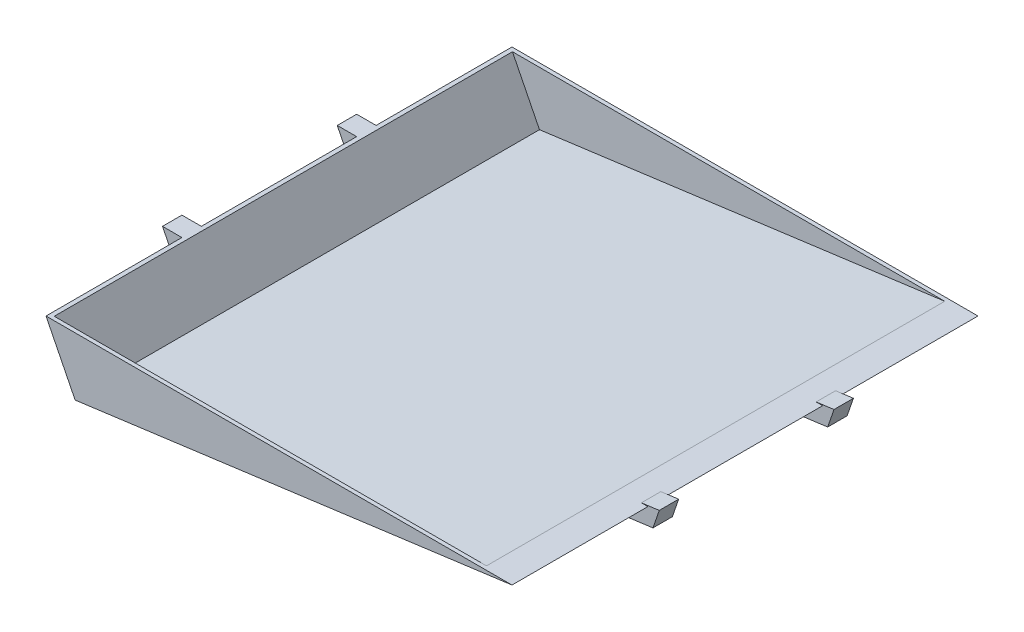
ISO-10303-21;
HEADER;
FILE_DESCRIPTION(('STEP AP214'),'2;1');
FILE_NAME('part.step','',(''),(''),'','','');
FILE_SCHEMA(('AUTOMOTIVE_DESIGN { 1 0 10303 214 1 1 1 1 }'));
ENDSEC;
DATA;
#1=APPLICATION_CONTEXT('core data for automotive mechanical design processes');
#2=APPLICATION_PROTOCOL_DEFINITION('international standard','automotive_design',2000,#1);
#3=PRODUCT_CONTEXT('',#1,'mechanical');
#4=PRODUCT('Part','Part','',(#3));
#5=PRODUCT_RELATED_PRODUCT_CATEGORY('part','',(#4));
#6=PRODUCT_DEFINITION_FORMATION('','',#4);
#7=PRODUCT_DEFINITION_CONTEXT('part definition',#1,'design');
#8=PRODUCT_DEFINITION('design','',#6,#7);
#9=PRODUCT_DEFINITION_SHAPE('','',#8);
#10=(LENGTH_UNIT() NAMED_UNIT(*) SI_UNIT(.MILLI.,.METRE.));
#11=(NAMED_UNIT(*) PLANE_ANGLE_UNIT() SI_UNIT($,.RADIAN.));
#12=(NAMED_UNIT(*) SI_UNIT($,.STERADIAN.) SOLID_ANGLE_UNIT());
#13=UNCERTAINTY_MEASURE_WITH_UNIT(LENGTH_MEASURE(1.E-05),#10,'distance_accuracy_value','');
#14=(GEOMETRIC_REPRESENTATION_CONTEXT(3) GLOBAL_UNCERTAINTY_ASSIGNED_CONTEXT((#13)) GLOBAL_UNIT_ASSIGNED_CONTEXT((#10,
#11,#12)) REPRESENTATION_CONTEXT('',''));
#15=CARTESIAN_POINT('',(0.,0.,0.));
#16=DIRECTION('',(0.,0.,1.));
#17=DIRECTION('',(1.,0.,0.));
#18=AXIS2_PLACEMENT_3D('',#15,#16,#17);
#19=CARTESIAN_POINT('',(599.249327743403,1302.62005408847,1349.8545563695));
#20=DIRECTION('',(0.894427190999916,0.447213595499958,0.));
#21=DIRECTION('',(-0.447213595499958,0.894427190999916,0.));
#22=AXIS2_PLACEMENT_3D('',#19,#20,#21);
#23=PLANE('',#22);
#24=DIRECTION('',(-0.447213595499958,0.894427190999916,0.));
#25=VECTOR('',#24,1.);
#26=CARTESIAN_POINT('',(599.249327743403,1302.62005408847,1553.0545563695));
#27=LINE('',#26,#25);
#28=CARTESIAN_POINT('',(599.249327743403,1302.62005408847,1553.0545563695));
#29=VERTEX_POINT('',#28);
#30=CARTESIAN_POINT('',(587.890102417704,1325.33850473987,1553.0545563695));
#31=VERTEX_POINT('',#30);
#32=EDGE_CURVE('E114',#29,#31,#27,.T.);
#33=ORIENTED_EDGE('',*,*,#32,.T.);
#34=DIRECTION('',(0.,0.,1.));
#35=VECTOR('',#34,1.);
#36=CARTESIAN_POINT('',(587.890102417704,1325.33850473987,1349.8545563695));
#37=LINE('',#36,#35);
#38=CARTESIAN_POINT('',(587.890102417704,1325.33850473987,1349.8545563695));
#39=VERTEX_POINT('',#38);
#40=EDGE_CURVE('E13',#39,#31,#37,.T.);
#41=ORIENTED_EDGE('',*,*,#40,.F.);
#42=DIRECTION('',(-0.447213595499958,0.894427190999916,0.));
#43=VECTOR('',#42,1.);
#44=CARTESIAN_POINT('',(599.249327743403,1302.62005408847,1349.8545563695));
#45=LINE('',#44,#43);
#46=CARTESIAN_POINT('',(599.249327743403,1302.62005408847,1349.8545563695));
#47=VERTEX_POINT('',#46);
#48=EDGE_CURVE('E102',#47,#39,#45,.T.);
#49=ORIENTED_EDGE('',*,*,#48,.F.);
#50=DIRECTION('',(0.,0.,1.));
#51=VECTOR('',#50,1.);
#52=CARTESIAN_POINT('',(599.249327743403,1302.62005408847,1349.8545563695));
#53=LINE('',#52,#51);
#54=EDGE_CURVE('E110',#47,#29,#53,.T.);
#55=ORIENTED_EDGE('',*,*,#54,.T.);
#56=EDGE_LOOP('',(#33,#41,#49,#55));
#57=FACE_BOUND('',#56,.T.);
#58=ADVANCED_FACE('F51',(#57),#23,.F.);
#59=CARTESIAN_POINT('',(612.850801769231,1326.21710603682,1349.8545563695));
#60=DIRECTION('',(0.0351776005049839,-0.999381076678317,0.));
#61=DIRECTION('',(0.999381076678317,0.0351776005049839,0.));
#62=AXIS2_PLACEMENT_3D('',#59,#60,#61);
#63=PLANE('',#62);
#64=DIRECTION('',(0.999381076678317,0.0351776005049839,0.));
#65=VECTOR('',#64,1.);
#66=CARTESIAN_POINT('',(612.850801769231,1326.21710603682,1553.0545563695));
#67=LINE('',#66,#65);
#68=CARTESIAN_POINT('',(612.850801769231,1326.21710603682,1553.0545563695));
#69=VERTEX_POINT('',#68);
#70=EDGE_CURVE('E106',#31,#69,#67,.T.);
#71=ORIENTED_EDGE('',*,*,#70,.T.);
#72=DIRECTION('',(0.,0.,1.));
#73=VECTOR('',#72,1.);
#74=CARTESIAN_POINT('',(612.850801769231,1326.21710603682,1349.8545563695));
#75=LINE('',#74,#73);
#76=CARTESIAN_POINT('',(612.850801769231,1326.21710603682,1349.8545563695));
#77=VERTEX_POINT('',#76);
#78=EDGE_CURVE('E59',#77,#69,#75,.T.);
#79=ORIENTED_EDGE('',*,*,#78,.F.);
#80=DIRECTION('',(0.999381076678317,0.0351776005049839,0.));
#81=VECTOR('',#80,1.);
#82=CARTESIAN_POINT('',(612.850801769231,1326.21710603682,1349.8545563695));
#83=LINE('',#82,#81);
#84=EDGE_CURVE('E97',#39,#77,#83,.T.);
#85=ORIENTED_EDGE('',*,*,#84,.F.);
#86=ORIENTED_EDGE('',*,*,#40,.T.);
#87=EDGE_LOOP('',(#71,#79,#85,#86));
#88=FACE_BOUND('',#87,.T.);
#89=ADVANCED_FACE('F105',(#88),#63,.F.);
#90=CARTESIAN_POINT('',(624.649327743403,1306.00672075514,1349.8545563695));
#91=DIRECTION('',(-0.863608967930153,-0.50416222638216,0.));
#92=DIRECTION('',(0.50416222638216,-0.863608967930153,0.));
#93=AXIS2_PLACEMENT_3D('',#90,#91,#92);
#94=PLANE('',#93);
#95=DIRECTION('',(0.50416222638216,-0.863608967930153,0.));
#96=VECTOR('',#95,1.);
#97=CARTESIAN_POINT('',(624.649327743403,1306.00672075514,1553.0545563695));
#98=LINE('',#97,#96);
#99=CARTESIAN_POINT('',(624.649327743403,1306.00672075514,1553.0545563695));
#100=VERTEX_POINT('',#99);
#101=EDGE_CURVE('E84',#69,#100,#98,.T.);
#102=ORIENTED_EDGE('',*,*,#101,.T.);
#103=DIRECTION('',(0.,0.,1.));
#104=VECTOR('',#103,1.);
#105=CARTESIAN_POINT('',(624.649327743403,1306.00672075514,1349.8545563695));
#106=LINE('',#105,#104);
#107=CARTESIAN_POINT('',(624.649327743403,1306.00672075514,1349.8545563695));
#108=VERTEX_POINT('',#107);
#109=EDGE_CURVE('E107',#108,#100,#106,.T.);
#110=ORIENTED_EDGE('',*,*,#109,.F.);
#111=DIRECTION('',(0.50416222638216,-0.863608967930153,0.));
#112=VECTOR('',#111,1.);
#113=CARTESIAN_POINT('',(624.649327743403,1306.00672075514,1349.8545563695));
#114=LINE('',#113,#112);
#115=EDGE_CURVE('E100',#77,#108,#114,.T.);
#116=ORIENTED_EDGE('',*,*,#115,.F.);
#117=ORIENTED_EDGE('',*,*,#78,.T.);
#118=EDGE_LOOP('',(#102,#110,#116,#117));
#119=FACE_BOUND('',#118,.T.);
#120=ADVANCED_FACE('F108',(#119),#94,.F.);
#121=CARTESIAN_POINT('',(599.249327743403,1302.62005408847,1349.8545563695));
#122=DIRECTION('',(-0.132163720091017,0.991227900682635,0.));
#123=DIRECTION('',(-0.991227900682635,-0.132163720091017,0.));
#124=AXIS2_PLACEMENT_3D('',#121,#122,#123);
#125=PLANE('',#124);
#126=DIRECTION('',(-0.991227900682635,-0.132163720091017,0.));
#127=VECTOR('',#126,1.);
#128=CARTESIAN_POINT('',(599.249327743403,1302.62005408847,1553.0545563695));
#129=LINE('',#128,#127);
#130=EDGE_CURVE('E90',#100,#29,#129,.T.);
#131=ORIENTED_EDGE('',*,*,#130,.T.);
#132=ORIENTED_EDGE('',*,*,#54,.F.);
#133=DIRECTION('',(-0.991227900682635,-0.132163720091017,0.));
#134=VECTOR('',#133,1.);
#135=CARTESIAN_POINT('',(599.249327743403,1302.62005408847,1349.8545563695));
#136=LINE('',#135,#134);
#137=EDGE_CURVE('E67',#108,#47,#136,.T.);
#138=ORIENTED_EDGE('',*,*,#137,.F.);
#139=ORIENTED_EDGE('',*,*,#109,.T.);
#140=EDGE_LOOP('',(#131,#132,#138,#139));
#141=FACE_BOUND('',#140,.T.);
#142=ADVANCED_FACE('F121',(#141),#125,.F.);
#143=CARTESIAN_POINT('',(0.,0.,1349.8545563695));
#144=DIRECTION('',(0.,0.,-1.));
#145=DIRECTION('',(-1.,0.,0.));
#146=AXIS2_PLACEMENT_3D('',#143,#144,#145);
#147=PLANE('',#146);
#148=ORIENTED_EDGE('',*,*,#48,.T.);
#149=ORIENTED_EDGE('',*,*,#84,.T.);
#150=ORIENTED_EDGE('',*,*,#115,.T.);
#151=ORIENTED_EDGE('',*,*,#137,.T.);
#152=EDGE_LOOP('',(#148,#149,#150,#151));
#153=FACE_BOUND('',#152,.T.);
#154=ADVANCED_FACE('F98',(#153),#147,.T.);
#155=CARTESIAN_POINT('',(0.,0.,1553.0545563695));
#156=DIRECTION('',(0.,0.,-1.));
#157=DIRECTION('',(-1.,0.,0.));
#158=AXIS2_PLACEMENT_3D('',#155,#156,#157);
#159=PLANE('',#158);
#160=ORIENTED_EDGE('',*,*,#32,.F.);
#161=ORIENTED_EDGE('',*,*,#130,.F.);
#162=ORIENTED_EDGE('',*,*,#101,.F.);
#163=ORIENTED_EDGE('',*,*,#70,.F.);
#164=EDGE_LOOP('',(#160,#161,#162,#163));
#165=FACE_BOUND('',#164,.T.);
#166=ADVANCED_FACE('F124',(#165),#159,.F.);
#167=CLOSED_SHELL('',(#58,#89,#120,#142,#154,#166));
#168=MANIFOLD_SOLID_BREP('B2',#167);
#169=CARTESIAN_POINT('',(1184.35080176923,1402.41710603682,1756.2545563695));
#170=DIRECTION('',(0.,-1.,0.));
#171=DIRECTION('',(0.,0.,-1.));
#172=AXIS2_PLACEMENT_3D('',#169,#170,#171);
#173=PLANE('',#172);
#174=DIRECTION('',(-1.,0.,0.));
#175=VECTOR('',#174,1.);
#176=CARTESIAN_POINT('',(0.,1402.41710603682,1151.7345563695));
#177=LINE('',#176,#175);
#178=CARTESIAN_POINT('',(1145.91362705516,1402.41710603682,1151.7345563695));
#179=VERTEX_POINT('',#178);
#180=CARTESIAN_POINT('',(580.43041443208,1402.41710603682,1151.7345563695));
#181=VERTEX_POINT('',#180);
#182=EDGE_CURVE('E473',#179,#181,#177,.T.);
#183=ORIENTED_EDGE('',*,*,#182,.F.);
#184=DIRECTION('',(0.,0.,-1.));
#185=VECTOR('',#184,1.);
#186=CARTESIAN_POINT('',(1145.91362705516,1402.41710603682,1756.2545563695));
#187=LINE('',#186,#185);
#188=CARTESIAN_POINT('',(1145.91362705516,1402.41710603682,1751.1745563695));
#189=VERTEX_POINT('',#188);
#190=EDGE_CURVE('E465',#189,#179,#187,.T.);
#191=ORIENTED_EDGE('',*,*,#190,.F.);
#192=DIRECTION('',(-1.,0.,0.));
#193=VECTOR('',#192,1.);
#194=CARTESIAN_POINT('',(0.,1402.41710603682,1751.1745563695));
#195=LINE('',#194,#193);
#196=CARTESIAN_POINT('',(580.43041443208,1402.41710603682,1751.1745563695));
#197=VERTEX_POINT('',#196);
#198=EDGE_CURVE('E475',#189,#197,#195,.T.);
#199=ORIENTED_EDGE('',*,*,#198,.T.);
#200=DIRECTION('',(0.,0.,-1.));
#201=VECTOR('',#200,1.);
#202=CARTESIAN_POINT('',(580.43041443208,1402.41710603682,1756.2545563695));
#203=LINE('',#202,#201);
#204=EDGE_CURVE('E464',#197,#181,#203,.T.);
#205=ORIENTED_EDGE('',*,*,#204,.T.);
#206=EDGE_LOOP('',(#183,#191,#199,#205));
#207=FACE_BOUND('',#206,.T.);
#208=DIRECTION('',(-1.,0.,0.));
#209=VECTOR('',#208,1.);
#210=CARTESIAN_POINT('',(1184.35080176923,1402.41710603682,1324.4545563695));
#211=LINE('',#210,#209);
#212=CARTESIAN_POINT('',(1184.35080176923,1402.41710603682,1324.4545563695));
#213=VERTEX_POINT('',#212);
#214=CARTESIAN_POINT('',(1175.83094630859,1402.41710603682,1324.4545563695));
#215=VERTEX_POINT('',#214);
#216=EDGE_CURVE('E395',#213,#215,#211,.T.);
#217=ORIENTED_EDGE('',*,*,#216,.F.);
#218=DIRECTION('',(0.,0.,-1.));
#219=VECTOR('',#218,1.);
#220=CARTESIAN_POINT('',(1184.35080176923,1402.41710603682,1756.2545563695));
#221=LINE('',#220,#219);
#222=CARTESIAN_POINT('',(1184.35080176923,1402.41710603682,1146.6545563695));
#223=VERTEX_POINT('',#222);
#224=EDGE_CURVE('E178',#213,#223,#221,.T.);
#225=ORIENTED_EDGE('',*,*,#224,.T.);
#226=DIRECTION('',(-1.,0.,0.));
#227=VECTOR('',#226,1.);
#228=CARTESIAN_POINT('',(1184.35080176923,1402.41710603682,1146.6545563695));
#229=LINE('',#228,#227);
#230=CARTESIAN_POINT('',(574.750801769231,1402.41710603682,1146.6545563695));
#231=VERTEX_POINT('',#230);
#232=EDGE_CURVE('E525',#223,#231,#229,.T.);
#233=ORIENTED_EDGE('',*,*,#232,.T.);
#234=DIRECTION('',(0.,0.,-1.));
#235=VECTOR('',#234,1.);
#236=CARTESIAN_POINT('',(574.750801769231,1402.41710603682,1756.2545563695));
#237=LINE('',#236,#235);
#238=CARTESIAN_POINT('',(574.750801769231,1402.41710603682,1324.4545563695));
#239=VERTEX_POINT('',#238);
#240=EDGE_CURVE('E351',#239,#231,#237,.T.);
#241=ORIENTED_EDGE('',*,*,#240,.F.);
#242=DIRECTION('',(1.,0.,0.));
#243=VECTOR('',#242,1.);
#244=CARTESIAN_POINT('',(574.750801769231,1402.41710603682,1324.4545563695));
#245=LINE('',#244,#243);
#246=CARTESIAN_POINT('',(549.350801769231,1402.41710603682,1324.4545563695));
#247=VERTEX_POINT('',#246);
#248=EDGE_CURVE('E346',#239,#247,#245,.F.);
#249=ORIENTED_EDGE('',*,*,#248,.T.);
#250=DIRECTION('',(0.,0.,-1.));
#251=VECTOR('',#250,1.);
#252=CARTESIAN_POINT('',(549.350801769231,1402.41710603682,1349.8545563695));
#253=LINE('',#252,#251);
#254=CARTESIAN_POINT('',(549.350801769231,1402.41710603682,1349.8545563695));
#255=VERTEX_POINT('',#254);
#256=EDGE_CURVE('E337',#247,#255,#253,.F.);
#257=ORIENTED_EDGE('',*,*,#256,.T.);
#258=DIRECTION('',(-1.,0.,0.));
#259=VECTOR('',#258,1.);
#260=CARTESIAN_POINT('',(574.750801769231,1402.41710603682,1349.8545563695));
#261=LINE('',#260,#259);
#262=CARTESIAN_POINT('',(574.750801769231,1402.41710603682,1349.8545563695));
#263=VERTEX_POINT('',#262);
#264=EDGE_CURVE('E345',#255,#263,#261,.F.);
#265=ORIENTED_EDGE('',*,*,#264,.T.);
#266=CARTESIAN_POINT('',(574.750801769231,1402.41710603682,1553.0545563695));
#267=VERTEX_POINT('',#266);
#268=EDGE_CURVE('E503',#267,#263,#237,.T.);
#269=ORIENTED_EDGE('',*,*,#268,.F.);
#270=DIRECTION('',(-1.,0.,0.));
#271=VECTOR('',#270,1.);
#272=CARTESIAN_POINT('',(574.750801769231,1402.41710603682,1553.0545563695));
#273=LINE('',#272,#271);
#274=CARTESIAN_POINT('',(549.350801769231,1402.41710603682,1553.0545563695));
#275=VERTEX_POINT('',#274);
#276=EDGE_CURVE('E419',#267,#275,#273,.T.);
#277=ORIENTED_EDGE('',*,*,#276,.T.);
#278=DIRECTION('',(0.,0.,1.));
#279=VECTOR('',#278,1.);
#280=CARTESIAN_POINT('',(549.350801769231,1402.41710603682,1553.0545563695));
#281=LINE('',#280,#279);
#282=CARTESIAN_POINT('',(549.350801769231,1402.41710603682,1578.4545563695));
#283=VERTEX_POINT('',#282);
#284=EDGE_CURVE('E407',#275,#283,#281,.T.);
#285=ORIENTED_EDGE('',*,*,#284,.T.);
#286=DIRECTION('',(1.,0.,0.));
#287=VECTOR('',#286,1.);
#288=CARTESIAN_POINT('',(574.750801769231,1402.41710603682,1578.4545563695));
#289=LINE('',#288,#287);
#290=CARTESIAN_POINT('',(574.750801769231,1402.41710603682,1578.4545563695));
#291=VERTEX_POINT('',#290);
#292=EDGE_CURVE('E410',#283,#291,#289,.T.);
#293=ORIENTED_EDGE('',*,*,#292,.T.);
#294=CARTESIAN_POINT('',(574.750801769231,1402.41710603682,1756.2545563695));
#295=VERTEX_POINT('',#294);
#296=EDGE_CURVE('E510',#295,#291,#237,.T.);
#297=ORIENTED_EDGE('',*,*,#296,.F.);
#298=DIRECTION('',(-1.,0.,0.));
#299=VECTOR('',#298,1.);
#300=CARTESIAN_POINT('',(1184.35080176923,1402.41710603682,1756.2545563695));
#301=LINE('',#300,#299);
#302=CARTESIAN_POINT('',(1184.35080176923,1402.41710603682,1756.2545563695));
#303=VERTEX_POINT('',#302);
#304=EDGE_CURVE('E521',#303,#295,#301,.T.);
#305=ORIENTED_EDGE('',*,*,#304,.F.);
#306=CARTESIAN_POINT('',(1184.35080176923,1402.41710603682,1578.4545563695));
#307=VERTEX_POINT('',#306);
#308=EDGE_CURVE('E483',#303,#307,#221,.T.);
#309=ORIENTED_EDGE('',*,*,#308,.T.);
#310=DIRECTION('',(1.,0.,0.));
#311=VECTOR('',#310,1.);
#312=CARTESIAN_POINT('',(1184.35080176923,1402.41710603682,1578.4545563695));
#313=LINE('',#312,#311);
#314=CARTESIAN_POINT('',(1175.83094630859,1402.41710603682,1578.4545563695));
#315=VERTEX_POINT('',#314);
#316=EDGE_CURVE('E456',#315,#307,#313,.T.);
#317=ORIENTED_EDGE('',*,*,#316,.F.);
#318=DIRECTION('',(0.,0.,1.));
#319=VECTOR('',#318,1.);
#320=CARTESIAN_POINT('',(1175.83094630859,1402.41710603682,1756.2545563695));
#321=LINE('',#320,#319);
#322=CARTESIAN_POINT('',(1175.83094630859,1402.41710603682,1553.0545563695));
#323=VERTEX_POINT('',#322);
#324=EDGE_CURVE('E498',#323,#315,#321,.T.);
#325=ORIENTED_EDGE('',*,*,#324,.F.);
#326=DIRECTION('',(-1.,0.,0.));
#327=VECTOR('',#326,1.);
#328=CARTESIAN_POINT('',(1184.35080176923,1402.41710603682,1553.0545563695));
#329=LINE('',#328,#327);
#330=CARTESIAN_POINT('',(1184.35080176923,1402.41710603682,1553.0545563695));
#331=VERTEX_POINT('',#330);
#332=EDGE_CURVE('E450',#331,#323,#329,.T.);
#333=ORIENTED_EDGE('',*,*,#332,.F.);
#334=CARTESIAN_POINT('',(1184.35080176923,1402.41710603682,1349.8545563695));
#335=VERTEX_POINT('',#334);
#336=EDGE_CURVE('E486',#331,#335,#221,.T.);
#337=ORIENTED_EDGE('',*,*,#336,.T.);
#338=DIRECTION('',(1.,0.,0.));
#339=VECTOR('',#338,1.);
#340=CARTESIAN_POINT('',(1184.35080176923,1402.41710603682,1349.8545563695));
#341=LINE('',#340,#339);
#342=CARTESIAN_POINT('',(1175.83094630859,1402.41710603682,1349.8545563695));
#343=VERTEX_POINT('',#342);
#344=EDGE_CURVE('E196',#343,#335,#341,.T.);
#345=ORIENTED_EDGE('',*,*,#344,.F.);
#346=DIRECTION('',(0.,0.,1.));
#347=VECTOR('',#346,1.);
#348=CARTESIAN_POINT('',(1175.83094630859,1402.41710603682,1756.2545563695));
#349=LINE('',#348,#347);
#350=EDGE_CURVE('E191',#215,#343,#349,.T.);
#351=ORIENTED_EDGE('',*,*,#350,.F.);
#352=EDGE_LOOP('',(#217,#225,#233,#241,#249,#257,#265,#269,#277,#285,#293,#297,#305,#309,#317,
#325,#333,#337,#345,#351));
#353=FACE_BOUND('',#352,.T.);
#354=ADVANCED_FACE('F174',(#207,#353),#173,.F.);
#355=CARTESIAN_POINT('',(612.850801769231,1326.21710603682,1756.2545563695));
#356=DIRECTION('',(-0.132163720091018,0.991227900682635,0.));
#357=DIRECTION('',(-0.991227900682635,-0.132163720091018,0.));
#358=AXIS2_PLACEMENT_3D('',#355,#356,#357);
#359=PLANE('',#358);
#360=DIRECTION('',(0.991227900682635,0.132163720091018,0.));
#361=VECTOR('',#360,1.);
#362=CARTESIAN_POINT('',(612.850801769231,1326.21710603682,1324.4545563695));
#363=LINE('',#362,#361);
#364=CARTESIAN_POINT('',(612.850801769231,1326.21710603682,1324.4545563695));
#365=VERTEX_POINT('',#364);
#366=EDGE_CURVE('E392',#365,#213,#363,.T.);
#367=ORIENTED_EDGE('',*,*,#366,.F.);
#368=DIRECTION('',(0.,0.,-1.));
#369=VECTOR('',#368,1.);
#370=CARTESIAN_POINT('',(612.850801769231,1326.21710603682,1756.2545563695));
#371=LINE('',#370,#369);
#372=CARTESIAN_POINT('',(612.850801769231,1326.21710603682,1146.6545563695));
#373=VERTEX_POINT('',#372);
#374=EDGE_CURVE('E504',#365,#373,#371,.T.);
#375=ORIENTED_EDGE('',*,*,#374,.T.);
#376=DIRECTION('',(0.991227900682635,0.132163720091018,0.));
#377=VECTOR('',#376,1.);
#378=CARTESIAN_POINT('',(612.850801769231,1326.21710603682,1146.6545563695));
#379=LINE('',#378,#377);
#380=EDGE_CURVE('E480',#373,#223,#379,.T.);
#381=ORIENTED_EDGE('',*,*,#380,.T.);
#382=ORIENTED_EDGE('',*,*,#224,.F.);
#383=EDGE_LOOP('',(#367,#375,#381,#382));
#384=FACE_BOUND('',#383,.T.);
#385=ADVANCED_FACE('F561',(#384),#359,.F.);
#386=DIRECTION('',(-0.991227900682635,-0.132163720091018,0.));
#387=VECTOR('',#386,1.);
#388=CARTESIAN_POINT('',(612.850801769231,1326.21710603682,1349.8545563695));
#389=LINE('',#388,#387);
#390=CARTESIAN_POINT('',(612.850801769231,1326.21710603682,1349.8545563695));
#391=VERTEX_POINT('',#390);
#392=EDGE_CURVE('E388',#335,#391,#389,.T.);
#393=ORIENTED_EDGE('',*,*,#392,.F.);
#394=ORIENTED_EDGE('',*,*,#336,.F.);
#395=DIRECTION('',(0.991227900682635,0.132163720091018,0.));
#396=VECTOR('',#395,1.);
#397=CARTESIAN_POINT('',(612.850801769231,1326.21710603682,1553.0545563695));
#398=LINE('',#397,#396);
#399=CARTESIAN_POINT('',(612.850801769231,1326.21710603682,1553.0545563695));
#400=VERTEX_POINT('',#399);
#401=EDGE_CURVE('E402',#400,#331,#398,.T.);
#402=ORIENTED_EDGE('',*,*,#401,.F.);
#403=EDGE_CURVE('E518',#400,#391,#371,.T.);
#404=ORIENTED_EDGE('',*,*,#403,.T.);
#405=EDGE_LOOP('',(#393,#394,#402,#404));
#406=FACE_BOUND('',#405,.T.);
#407=ADVANCED_FACE('F616',(#406),#359,.F.);
#408=CARTESIAN_POINT('',(574.750801769231,1402.41710603682,1756.2545563695));
#409=DIRECTION('',(0.894427190999916,0.447213595499958,0.));
#410=DIRECTION('',(-0.447213595499958,0.894427190999916,0.));
#411=AXIS2_PLACEMENT_3D('',#408,#409,#410);
#412=PLANE('',#411);
#413=DIRECTION('',(-0.447213595499958,0.894427190999916,0.));
#414=VECTOR('',#413,1.);
#415=CARTESIAN_POINT('',(574.750801769231,1402.41710603682,1349.8545563695));
#416=LINE('',#415,#414);
#417=CARTESIAN_POINT('',(612.318310802941,1327.2820879694,1349.8545563695));
#418=VERTEX_POINT('',#417);
#419=EDGE_CURVE('E49',#391,#418,#416,.T.);
#420=ORIENTED_EDGE('',*,*,#419,.F.);
#421=ORIENTED_EDGE('',*,*,#403,.F.);
#422=DIRECTION('',(0.447213595499958,-0.894427190999916,0.));
#423=VECTOR('',#422,1.);
#424=CARTESIAN_POINT('',(574.750801769231,1402.41710603682,1553.0545563695));
#425=LINE('',#424,#423);
#426=CARTESIAN_POINT('',(612.318310802941,1327.2820879694,1553.0545563695));
#427=VERTEX_POINT('',#426);
#428=EDGE_CURVE('E519',#427,#400,#425,.T.);
#429=ORIENTED_EDGE('',*,*,#428,.F.);
#430=DIRECTION('',(0.447213595499957,-0.894427190999916,0.));
#431=VECTOR('',#430,1.);
#432=CARTESIAN_POINT('',(574.750801769231,1402.41710603682,1553.0545563695));
#433=LINE('',#432,#431);
#434=EDGE_CURVE('E423',#267,#427,#433,.T.);
#435=ORIENTED_EDGE('',*,*,#434,.F.);
#436=ORIENTED_EDGE('',*,*,#268,.T.);
#437=DIRECTION('',(0.447213595499957,-0.894427190999916,0.));
#438=VECTOR('',#437,1.);
#439=CARTESIAN_POINT('',(574.750801769231,1402.41710603682,1349.8545563695));
#440=LINE('',#439,#438);
#441=EDGE_CURVE('E364',#263,#418,#440,.T.);
#442=ORIENTED_EDGE('',*,*,#441,.T.);
#443=EDGE_LOOP('',(#420,#421,#429,#435,#436,#442));
#444=FACE_BOUND('',#443,.T.);
#445=ADVANCED_FACE('F576',(#444),#412,.F.);
#446=DIRECTION('',(0.447213595499958,-0.894427190999916,0.));
#447=VECTOR('',#446,1.);
#448=CARTESIAN_POINT('',(574.750801769231,1402.41710603682,1324.4545563695));
#449=LINE('',#448,#447);
#450=CARTESIAN_POINT('',(612.31831080294,1327.2820879694,1324.4545563695));
#451=VERTEX_POINT('',#450);
#452=EDGE_CURVE('E184',#451,#365,#449,.T.);
#453=ORIENTED_EDGE('',*,*,#452,.F.);
#454=DIRECTION('',(0.447213595499957,-0.894427190999916,0.));
#455=VECTOR('',#454,1.);
#456=CARTESIAN_POINT('',(574.750801769231,1402.41710603682,1324.4545563695));
#457=LINE('',#456,#455);
#458=EDGE_CURVE('E360',#239,#451,#457,.T.);
#459=ORIENTED_EDGE('',*,*,#458,.F.);
#460=ORIENTED_EDGE('',*,*,#240,.T.);
#461=DIRECTION('',(0.447213595499958,-0.894427190999916,0.));
#462=VECTOR('',#461,1.);
#463=CARTESIAN_POINT('',(574.750801769231,1402.41710603682,1146.6545563695));
#464=LINE('',#463,#462);
#465=EDGE_CURVE('E485',#231,#373,#464,.T.);
#466=ORIENTED_EDGE('',*,*,#465,.T.);
#467=ORIENTED_EDGE('',*,*,#374,.F.);
#468=EDGE_LOOP('',(#453,#459,#460,#466,#467));
#469=FACE_BOUND('',#468,.T.);
#470=ADVANCED_FACE('F564',(#469),#412,.F.);
#471=DIRECTION('',(-0.991227900682635,-0.132163720091018,0.));
#472=VECTOR('',#471,1.);
#473=CARTESIAN_POINT('',(612.850801769231,1326.21710603682,1578.4545563695));
#474=LINE('',#473,#472);
#475=CARTESIAN_POINT('',(612.850801769231,1326.21710603682,1578.4545563695));
#476=VERTEX_POINT('',#475);
#477=EDGE_CURVE('E453',#307,#476,#474,.T.);
#478=ORIENTED_EDGE('',*,*,#477,.F.);
#479=ORIENTED_EDGE('',*,*,#308,.F.);
#480=DIRECTION('',(0.991227900682635,0.132163720091018,0.));
#481=VECTOR('',#480,1.);
#482=CARTESIAN_POINT('',(612.850801769231,1326.21710603682,1756.2545563695));
#483=LINE('',#482,#481);
#484=CARTESIAN_POINT('',(612.850801769231,1326.21710603682,1756.2545563695));
#485=VERTEX_POINT('',#484);
#486=EDGE_CURVE('E489',#485,#303,#483,.T.);
#487=ORIENTED_EDGE('',*,*,#486,.F.);
#488=EDGE_CURVE('E545',#485,#476,#371,.T.);
#489=ORIENTED_EDGE('',*,*,#488,.T.);
#490=EDGE_LOOP('',(#478,#479,#487,#489));
#491=FACE_BOUND('',#490,.T.);
#492=ADVANCED_FACE('F604',(#491),#359,.F.);
#493=DIRECTION('',(-0.447213595499958,0.894427190999916,0.));
#494=VECTOR('',#493,1.);
#495=CARTESIAN_POINT('',(574.750801769231,1402.41710603682,1578.4545563695));
#496=LINE('',#495,#494);
#497=CARTESIAN_POINT('',(612.31831080294,1327.2820879694,1578.4545563695));
#498=VERTEX_POINT('',#497);
#499=EDGE_CURVE('E496',#476,#498,#496,.T.);
#500=ORIENTED_EDGE('',*,*,#499,.F.);
#501=ORIENTED_EDGE('',*,*,#488,.F.);
#502=DIRECTION('',(0.447213595499958,-0.894427190999916,0.));
#503=VECTOR('',#502,1.);
#504=CARTESIAN_POINT('',(574.750801769231,1402.41710603682,1756.2545563695));
#505=LINE('',#504,#503);
#506=EDGE_CURVE('E512',#295,#485,#505,.T.);
#507=ORIENTED_EDGE('',*,*,#506,.F.);
#508=ORIENTED_EDGE('',*,*,#296,.T.);
#509=DIRECTION('',(0.447213595499957,-0.894427190999916,0.));
#510=VECTOR('',#509,1.);
#511=CARTESIAN_POINT('',(574.750801769231,1402.41710603682,1578.4545563695));
#512=LINE('',#511,#510);
#513=EDGE_CURVE('E415',#291,#498,#512,.T.);
#514=ORIENTED_EDGE('',*,*,#513,.T.);
#515=EDGE_LOOP('',(#500,#501,#507,#508,#514));
#516=FACE_BOUND('',#515,.T.);
#517=ADVANCED_FACE('F599',(#516),#412,.F.);
#518=CARTESIAN_POINT('',(0.,0.,1146.6545563695));
#519=DIRECTION('',(0.,0.,-1.));
#520=DIRECTION('',(-1.,0.,0.));
#521=AXIS2_PLACEMENT_3D('',#518,#519,#520);
#522=PLANE('',#521);
#523=ORIENTED_EDGE('',*,*,#232,.F.);
#524=ORIENTED_EDGE('',*,*,#380,.F.);
#525=ORIENTED_EDGE('',*,*,#465,.F.);
#526=EDGE_LOOP('',(#523,#524,#525));
#527=FACE_BOUND('',#526,.T.);
#528=ADVANCED_FACE('F176',(#527),#522,.T.);
#529=CARTESIAN_POINT('',(0.,0.,1756.2545563695));
#530=DIRECTION('',(0.,0.,-1.));
#531=DIRECTION('',(-1.,0.,0.));
#532=AXIS2_PLACEMENT_3D('',#529,#530,#531);
#533=PLANE('',#532);
#534=ORIENTED_EDGE('',*,*,#304,.T.);
#535=ORIENTED_EDGE('',*,*,#506,.T.);
#536=ORIENTED_EDGE('',*,*,#486,.T.);
#537=EDGE_LOOP('',(#534,#535,#536));
#538=FACE_BOUND('',#537,.T.);
#539=ADVANCED_FACE('F632',(#538),#533,.F.);
#540=CARTESIAN_POINT('',(0.,0.,1151.7345563695));
#541=DIRECTION('',(0.,0.,-1.));
#542=DIRECTION('',(-1.,0.,0.));
#543=AXIS2_PLACEMENT_3D('',#540,#541,#542);
#544=PLANE('',#543);
#545=ORIENTED_EDGE('',*,*,#182,.T.);
#546=DIRECTION('',(0.447213595499958,-0.894427190999916,0.));
#547=VECTOR('',#546,1.);
#548=CARTESIAN_POINT('',(1025.31117396039,512.655586980196,1151.7345563695));
#549=LINE('',#548,#547);
#550=CARTESIAN_POINT('',(615.773115221023,1331.73170445893,1151.7345563695));
#551=VERTEX_POINT('',#550);
#552=EDGE_CURVE('E462',#181,#551,#549,.T.);
#553=ORIENTED_EDGE('',*,*,#552,.T.);
#554=DIRECTION('',(0.991227900682635,0.132163720091018,0.));
#555=VECTOR('',#554,1.);
#556=CARTESIAN_POINT('',(-163.706806431808,1227.80104823856,1151.7345563695));
#557=LINE('',#556,#555);
#558=EDGE_CURVE('E459',#551,#179,#557,.T.);
#559=ORIENTED_EDGE('',*,*,#558,.T.);
#560=EDGE_LOOP('',(#545,#553,#559));
#561=FACE_BOUND('',#560,.T.);
#562=ADVANCED_FACE('F634',(#561),#544,.F.);
#563=CARTESIAN_POINT('',(0.,0.,1751.1745563695));
#564=DIRECTION('',(0.,0.,-1.));
#565=DIRECTION('',(-1.,0.,0.));
#566=AXIS2_PLACEMENT_3D('',#563,#564,#565);
#567=PLANE('',#566);
#568=ORIENTED_EDGE('',*,*,#198,.F.);
#569=DIRECTION('',(0.991227900682635,0.132163720091018,0.));
#570=VECTOR('',#569,1.);
#571=CARTESIAN_POINT('',(-163.706806431808,1227.80104823856,1751.1745563695));
#572=LINE('',#571,#570);
#573=CARTESIAN_POINT('',(615.773115221023,1331.73170445893,1751.1745563695));
#574=VERTEX_POINT('',#573);
#575=EDGE_CURVE('E466',#574,#189,#572,.T.);
#576=ORIENTED_EDGE('',*,*,#575,.F.);
#577=DIRECTION('',(0.447213595499958,-0.894427190999916,0.));
#578=VECTOR('',#577,1.);
#579=CARTESIAN_POINT('',(1025.31117396039,512.655586980196,1751.1745563695));
#580=LINE('',#579,#578);
#581=EDGE_CURVE('E470',#197,#574,#580,.T.);
#582=ORIENTED_EDGE('',*,*,#581,.F.);
#583=EDGE_LOOP('',(#568,#576,#582));
#584=FACE_BOUND('',#583,.T.);
#585=ADVANCED_FACE('F639',(#584),#567,.T.);
#586=CARTESIAN_POINT('',(612.179410071168,1331.25254377229,1756.2545563695));
#587=DIRECTION('',(-0.132163720091018,0.991227900682635,0.));
#588=DIRECTION('',(-0.991227900682635,-0.132163720091018,0.));
#589=AXIS2_PLACEMENT_3D('',#586,#587,#588);
#590=PLANE('',#589);
#591=ORIENTED_EDGE('',*,*,#558,.F.);
#592=DIRECTION('',(0.,0.,-1.));
#593=VECTOR('',#592,1.);
#594=CARTESIAN_POINT('',(615.773115221023,1331.73170445893,1756.2545563695));
#595=LINE('',#594,#593);
#596=EDGE_CURVE('E461',#574,#551,#595,.T.);
#597=ORIENTED_EDGE('',*,*,#596,.F.);
#598=ORIENTED_EDGE('',*,*,#575,.T.);
#599=ORIENTED_EDGE('',*,*,#190,.T.);
#600=EDGE_LOOP('',(#591,#597,#598,#599));
#601=FACE_BOUND('',#600,.T.);
#602=ADVANCED_FACE('F783',(#601),#590,.T.);
#603=CARTESIAN_POINT('',(579.29449189951,1404.68895110196,1756.2545563695));
#604=DIRECTION('',(0.894427190999916,0.447213595499958,0.));
#605=DIRECTION('',(-0.447213595499958,0.894427190999916,0.));
#606=AXIS2_PLACEMENT_3D('',#603,#604,#605);
#607=PLANE('',#606);
#608=ORIENTED_EDGE('',*,*,#552,.F.);
#609=ORIENTED_EDGE('',*,*,#204,.F.);
#610=ORIENTED_EDGE('',*,*,#581,.T.);
#611=ORIENTED_EDGE('',*,*,#596,.T.);
#612=EDGE_LOOP('',(#608,#609,#610,#611));
#613=FACE_BOUND('',#612,.T.);
#614=ADVANCED_FACE('F642',(#613),#607,.T.);
#615=CARTESIAN_POINT('',(607.166633226547,1326.59519762588,1553.0545563695));
#616=DIRECTION('',(0.132163720091018,-0.991227900682635,0.));
#617=DIRECTION('',(0.991227900682635,0.132163720091018,0.));
#618=AXIS2_PLACEMENT_3D('',#615,#616,#617);
#619=PLANE('',#618);
#620=DIRECTION('',(0.991227900682635,0.132163720091018,0.));
#621=VECTOR('',#620,1.);
#622=CARTESIAN_POINT('',(607.166633226547,1326.59519762588,1553.0545563695));
#623=LINE('',#622,#621);
#624=CARTESIAN_POINT('',(1199.19233233326,1405.53195750678,1553.0545563695));
#625=VERTEX_POINT('',#624);
#626=EDGE_CURVE('E439',#323,#625,#623,.T.);
#627=ORIENTED_EDGE('',*,*,#626,.F.);
#628=ORIENTED_EDGE('',*,*,#324,.T.);
#629=DIRECTION('',(0.991227900682635,0.132163720091018,0.));
#630=VECTOR('',#629,1.);
#631=CARTESIAN_POINT('',(607.166633226547,1326.59519762588,1578.4545563695));
#632=LINE('',#631,#630);
#633=CARTESIAN_POINT('',(1199.19233233326,1405.53195750678,1578.4545563695));
#634=VERTEX_POINT('',#633);
#635=EDGE_CURVE('E441',#315,#634,#632,.T.);
#636=ORIENTED_EDGE('',*,*,#635,.T.);
#637=DIRECTION('',(0.,0.,-1.));
#638=VECTOR('',#637,1.);
#639=CARTESIAN_POINT('',(1199.19233233326,1405.53195750678,1553.0545563695));
#640=LINE('',#639,#638);
#641=EDGE_CURVE('E431',#634,#625,#640,.T.);
#642=ORIENTED_EDGE('',*,*,#641,.T.);
#643=EDGE_LOOP('',(#627,#628,#636,#642));
#644=FACE_BOUND('',#643,.T.);
#645=ADVANCED_FACE('F607',(#644),#619,.F.);
#646=CARTESIAN_POINT('',(607.166633226547,1326.59519762588,1578.4545563695));
#647=DIRECTION('',(0.,0.,-1.));
#648=DIRECTION('',(-1.,0.,0.));
#649=AXIS2_PLACEMENT_3D('',#646,#647,#648);
#650=PLANE('',#649);
#651=ORIENTED_EDGE('',*,*,#635,.F.);
#652=ORIENTED_EDGE('',*,*,#316,.T.);
#653=ORIENTED_EDGE('',*,*,#477,.T.);
#654=ORIENTED_EDGE('',*,*,#499,.T.);
#655=DIRECTION('',(-0.468240633468912,-0.883600989796091,0.));
#656=VECTOR('',#655,1.);
#657=CARTESIAN_POINT('',(635.167864718637,1370.40070479412,1578.4545563695));
#658=LINE('',#657,#656);
#659=CARTESIAN_POINT('',(599.249327743403,1302.62005408847,1578.4545563695));
#660=VERTEX_POINT('',#659);
#661=EDGE_CURVE('E399',#498,#660,#658,.T.);
#662=ORIENTED_EDGE('',*,*,#661,.T.);
#663=DIRECTION('',(0.991227900682635,0.132163720091018,0.));
#664=VECTOR('',#663,1.);
#665=CARTESIAN_POINT('',(598.909607106366,1302.57475800354,1578.4545563695));
#666=LINE('',#665,#664);
#667=CARTESIAN_POINT('',(1190.93530621308,1381.51151788443,1578.4545563695));
#668=VERTEX_POINT('',#667);
#669=EDGE_CURVE('E443',#660,#668,#666,.T.);
#670=ORIENTED_EDGE('',*,*,#669,.T.);
#671=DIRECTION('',(0.325079768511047,0.945686599304867,0.));
#672=VECTOR('',#671,1.);
#673=CARTESIAN_POINT('',(1199.19233233326,1405.53195750678,1578.4545563695));
#674=LINE('',#673,#672);
#675=EDGE_CURVE('E434',#668,#634,#674,.T.);
#676=ORIENTED_EDGE('',*,*,#675,.T.);
#677=EDGE_LOOP('',(#651,#652,#653,#654,#662,#670,#676));
#678=FACE_BOUND('',#677,.T.);
#679=ADVANCED_FACE('F602',(#678),#650,.F.);
#680=CARTESIAN_POINT('',(607.166633226547,1326.59519762588,1553.0545563695));
#681=DIRECTION('',(0.,0.,1.));
#682=DIRECTION('',(1.,0.,0.));
#683=AXIS2_PLACEMENT_3D('',#680,#681,#682);
#684=PLANE('',#683);
#685=ORIENTED_EDGE('',*,*,#401,.T.);
#686=ORIENTED_EDGE('',*,*,#332,.T.);
#687=ORIENTED_EDGE('',*,*,#626,.T.);
#688=DIRECTION('',(-0.325079768511047,-0.945686599304867,0.));
#689=VECTOR('',#688,1.);
#690=CARTESIAN_POINT('',(1199.19233233326,1405.53195750678,1553.0545563695));
#691=LINE('',#690,#689);
#692=CARTESIAN_POINT('',(1190.93530621308,1381.51151788443,1553.0545563695));
#693=VERTEX_POINT('',#692);
#694=EDGE_CURVE('E398',#625,#693,#691,.T.);
#695=ORIENTED_EDGE('',*,*,#694,.T.);
#696=DIRECTION('',(0.991227900682635,0.132163720091018,0.));
#697=VECTOR('',#696,1.);
#698=CARTESIAN_POINT('',(598.909607106366,1302.57475800354,1553.0545563695));
#699=LINE('',#698,#697);
#700=CARTESIAN_POINT('',(599.249327743403,1302.62005408847,1553.0545563695));
#701=VERTEX_POINT('',#700);
#702=EDGE_CURVE('E411',#701,#693,#699,.T.);
#703=ORIENTED_EDGE('',*,*,#702,.F.);
#704=DIRECTION('',(0.468240633468912,0.883600989796091,0.));
#705=VECTOR('',#704,1.);
#706=CARTESIAN_POINT('',(635.167864718637,1370.40070479412,1553.0545563695));
#707=LINE('',#706,#705);
#708=EDGE_CURVE('E403',#701,#427,#707,.T.);
#709=ORIENTED_EDGE('',*,*,#708,.T.);
#710=ORIENTED_EDGE('',*,*,#428,.T.);
#711=EDGE_LOOP('',(#685,#686,#687,#695,#703,#709,#710));
#712=FACE_BOUND('',#711,.T.);
#713=ADVANCED_FACE('F614',(#712),#684,.F.);
#714=CARTESIAN_POINT('',(1012.35247474258,861.997826333885,0.));
#715=DIRECTION('',(0.945686599304867,-0.325079768511047,0.));
#716=DIRECTION('',(0.,0.,-1.));
#717=AXIS2_PLACEMENT_3D('',#714,#715,#716);
#718=PLANE('',#717);
#719=DIRECTION('',(0.,0.,1.));
#720=VECTOR('',#719,1.);
#721=CARTESIAN_POINT('',(1190.93530621308,1381.51151788443,1553.0545563695));
#722=LINE('',#721,#720);
#723=EDGE_CURVE('E437',#693,#668,#722,.T.);
#724=ORIENTED_EDGE('',*,*,#723,.F.);
#725=ORIENTED_EDGE('',*,*,#694,.F.);
#726=ORIENTED_EDGE('',*,*,#641,.F.);
#727=ORIENTED_EDGE('',*,*,#675,.F.);
#728=EDGE_LOOP('',(#724,#725,#726,#727));
#729=FACE_BOUND('',#728,.T.);
#730=ADVANCED_FACE('F613',(#729),#718,.T.);
#731=CARTESIAN_POINT('',(598.909607106366,1302.57475800354,1553.0545563695));
#732=DIRECTION('',(-0.132163720091018,0.991227900682635,0.));
#733=DIRECTION('',(-0.991227900682635,-0.132163720091018,0.));
#734=AXIS2_PLACEMENT_3D('',#731,#732,#733);
#735=PLANE('',#734);
#736=DIRECTION('',(0.,0.,-1.));
#737=VECTOR('',#736,1.);
#738=CARTESIAN_POINT('',(599.249327743403,1302.62005408847,1553.0545563695));
#739=LINE('',#738,#737);
#740=EDGE_CURVE('E406',#660,#701,#739,.T.);
#741=ORIENTED_EDGE('',*,*,#740,.T.);
#742=ORIENTED_EDGE('',*,*,#702,.T.);
#743=ORIENTED_EDGE('',*,*,#723,.T.);
#744=ORIENTED_EDGE('',*,*,#669,.F.);
#745=EDGE_LOOP('',(#741,#742,#743,#744));
#746=FACE_BOUND('',#745,.T.);
#747=ADVANCED_FACE('F769',(#746),#735,.F.);
#748=CARTESIAN_POINT('',(574.750801769231,1402.41710603682,1553.0545563695));
#749=DIRECTION('',(0.,0.,1.));
#750=DIRECTION('',(1.,0.,0.));
#751=AXIS2_PLACEMENT_3D('',#748,#749,#750);
#752=PLANE('',#751);
#753=DIRECTION('',(0.447213595499957,-0.894427190999916,0.));
#754=VECTOR('',#753,1.);
#755=CARTESIAN_POINT('',(549.350801769231,1402.41710603682,1553.0545563695));
#756=LINE('',#755,#754);
#757=EDGE_CURVE('E416',#275,#701,#756,.T.);
#758=ORIENTED_EDGE('',*,*,#757,.F.);
#759=ORIENTED_EDGE('',*,*,#276,.F.);
#760=ORIENTED_EDGE('',*,*,#434,.T.);
#761=ORIENTED_EDGE('',*,*,#708,.F.);
#762=EDGE_LOOP('',(#758,#759,#760,#761));
#763=FACE_BOUND('',#762,.T.);
#764=ADVANCED_FACE('F587',(#763),#752,.F.);
#765=CARTESIAN_POINT('',(574.750801769231,1402.41710603682,1578.4545563695));
#766=DIRECTION('',(0.,0.,-1.));
#767=DIRECTION('',(-1.,0.,0.));
#768=AXIS2_PLACEMENT_3D('',#765,#766,#767);
#769=PLANE('',#768);
#770=ORIENTED_EDGE('',*,*,#513,.F.);
#771=ORIENTED_EDGE('',*,*,#292,.F.);
#772=DIRECTION('',(0.447213595499957,-0.894427190999916,0.));
#773=VECTOR('',#772,1.);
#774=CARTESIAN_POINT('',(549.350801769231,1402.41710603682,1578.4545563695));
#775=LINE('',#774,#773);
#776=EDGE_CURVE('E412',#283,#660,#775,.T.);
#777=ORIENTED_EDGE('',*,*,#776,.T.);
#778=ORIENTED_EDGE('',*,*,#661,.F.);
#779=EDGE_LOOP('',(#770,#771,#777,#778));
#780=FACE_BOUND('',#779,.T.);
#781=ADVANCED_FACE('F597',(#780),#769,.F.);
#782=CARTESIAN_POINT('',(549.350801769231,1402.41710603682,1553.0545563695));
#783=DIRECTION('',(0.894427190999916,0.447213595499957,0.));
#784=DIRECTION('',(-0.447213595499957,0.894427190999917,0.));
#785=AXIS2_PLACEMENT_3D('',#782,#783,#784);
#786=PLANE('',#785);
#787=ORIENTED_EDGE('',*,*,#776,.F.);
#788=ORIENTED_EDGE('',*,*,#284,.F.);
#789=ORIENTED_EDGE('',*,*,#757,.T.);
#790=ORIENTED_EDGE('',*,*,#740,.F.);
#791=EDGE_LOOP('',(#787,#788,#789,#790));
#792=FACE_BOUND('',#791,.T.);
#793=ADVANCED_FACE('F591',(#792),#786,.F.);
#794=CARTESIAN_POINT('',(607.166633226547,1326.59519762588,1349.8545563695));
#795=DIRECTION('',(0.132163720091018,-0.991227900682635,0.));
#796=DIRECTION('',(0.991227900682635,0.132163720091018,0.));
#797=AXIS2_PLACEMENT_3D('',#794,#795,#796);
#798=PLANE('',#797);
#799=DIRECTION('',(0.991227900682635,0.132163720091018,0.));
#800=VECTOR('',#799,1.);
#801=CARTESIAN_POINT('',(607.166633226547,1326.59519762588,1324.4545563695));
#802=LINE('',#801,#800);
#803=CARTESIAN_POINT('',(1199.19233233326,1405.53195750678,1324.4545563695));
#804=VERTEX_POINT('',#803);
#805=EDGE_CURVE('E385',#215,#804,#802,.T.);
#806=ORIENTED_EDGE('',*,*,#805,.F.);
#807=ORIENTED_EDGE('',*,*,#350,.T.);
#808=DIRECTION('',(0.991227900682635,0.132163720091018,0.));
#809=VECTOR('',#808,1.);
#810=CARTESIAN_POINT('',(607.166633226547,1326.59519762588,1349.8545563695));
#811=LINE('',#810,#809);
#812=CARTESIAN_POINT('',(1199.19233233326,1405.53195750678,1349.8545563695));
#813=VERTEX_POINT('',#812);
#814=EDGE_CURVE('E354',#343,#813,#811,.T.);
#815=ORIENTED_EDGE('',*,*,#814,.T.);
#816=DIRECTION('',(0.,0.,1.));
#817=VECTOR('',#816,1.);
#818=CARTESIAN_POINT('',(1199.19233233326,1405.53195750678,1349.8545563695));
#819=LINE('',#818,#817);
#820=EDGE_CURVE('E376',#813,#804,#819,.F.);
#821=ORIENTED_EDGE('',*,*,#820,.T.);
#822=EDGE_LOOP('',(#806,#807,#815,#821));
#823=FACE_BOUND('',#822,.T.);
#824=ADVANCED_FACE('F693',(#823),#798,.F.);
#825=CARTESIAN_POINT('',(607.166633226547,1326.59519762588,1324.4545563695));
#826=DIRECTION('',(0.,0.,1.));
#827=DIRECTION('',(1.,0.,0.));
#828=AXIS2_PLACEMENT_3D('',#825,#826,#827);
#829=PLANE('',#828);
#830=ORIENTED_EDGE('',*,*,#366,.T.);
#831=ORIENTED_EDGE('',*,*,#216,.T.);
#832=ORIENTED_EDGE('',*,*,#805,.T.);
#833=DIRECTION('',(0.325079768511047,0.945686599304867,0.));
#834=VECTOR('',#833,1.);
#835=CARTESIAN_POINT('',(1199.19233233326,1405.53195750678,1324.4545563695));
#836=LINE('',#835,#834);
#837=CARTESIAN_POINT('',(1190.93530621308,1381.51151788443,1324.4545563695));
#838=VERTEX_POINT('',#837);
#839=EDGE_CURVE('E374',#804,#838,#836,.F.);
#840=ORIENTED_EDGE('',*,*,#839,.T.);
#841=DIRECTION('',(0.991227900682635,0.132163720091018,0.));
#842=VECTOR('',#841,1.);
#843=CARTESIAN_POINT('',(598.909607106366,1302.57475800354,1324.4545563695));
#844=LINE('',#843,#842);
#845=CARTESIAN_POINT('',(599.249327743403,1302.62005408847,1324.4545563695));
#846=VERTEX_POINT('',#845);
#847=EDGE_CURVE('E382',#846,#838,#844,.T.);
#848=ORIENTED_EDGE('',*,*,#847,.F.);
#849=DIRECTION('',(0.468240633468912,0.883600989796091,0.));
#850=VECTOR('',#849,1.);
#851=CARTESIAN_POINT('',(635.167864718637,1370.40070479412,1324.4545563695));
#852=LINE('',#851,#850);
#853=EDGE_CURVE('E358',#846,#451,#852,.T.);
#854=ORIENTED_EDGE('',*,*,#853,.T.);
#855=ORIENTED_EDGE('',*,*,#452,.T.);
#856=EDGE_LOOP('',(#830,#831,#832,#840,#848,#854,#855));
#857=FACE_BOUND('',#856,.T.);
#858=ADVANCED_FACE('F567',(#857),#829,.F.);
#859=CARTESIAN_POINT('',(607.166633226547,1326.59519762588,1349.8545563695));
#860=DIRECTION('',(0.,0.,-1.));
#861=DIRECTION('',(-1.,0.,0.));
#862=AXIS2_PLACEMENT_3D('',#859,#860,#861);
#863=PLANE('',#862);
#864=ORIENTED_EDGE('',*,*,#814,.F.);
#865=ORIENTED_EDGE('',*,*,#344,.T.);
#866=ORIENTED_EDGE('',*,*,#392,.T.);
#867=ORIENTED_EDGE('',*,*,#419,.T.);
#868=DIRECTION('',(-0.468240633468912,-0.883600989796091,0.));
#869=VECTOR('',#868,1.);
#870=CARTESIAN_POINT('',(635.167864718637,1370.40070479412,1349.8545563695));
#871=LINE('',#870,#869);
#872=CARTESIAN_POINT('',(599.249327743403,1302.62005408847,1349.8545563695));
#873=VERTEX_POINT('',#872);
#874=EDGE_CURVE('E362',#418,#873,#871,.T.);
#875=ORIENTED_EDGE('',*,*,#874,.T.);
#876=DIRECTION('',(0.991227900682635,0.132163720091018,0.));
#877=VECTOR('',#876,1.);
#878=CARTESIAN_POINT('',(598.909607106366,1302.57475800354,1349.8545563695));
#879=LINE('',#878,#877);
#880=CARTESIAN_POINT('',(1190.93530621308,1381.51151788443,1349.8545563695));
#881=VERTEX_POINT('',#880);
#882=EDGE_CURVE('E379',#873,#881,#879,.T.);
#883=ORIENTED_EDGE('',*,*,#882,.T.);
#884=DIRECTION('',(-0.325079768511047,-0.945686599304867,0.));
#885=VECTOR('',#884,1.);
#886=CARTESIAN_POINT('',(1199.19233233326,1405.53195750678,1349.8545563695));
#887=LINE('',#886,#885);
#888=EDGE_CURVE('E369',#881,#813,#887,.F.);
#889=ORIENTED_EDGE('',*,*,#888,.T.);
#890=EDGE_LOOP('',(#864,#865,#866,#867,#875,#883,#889));
#891=FACE_BOUND('',#890,.T.);
#892=ADVANCED_FACE('F582',(#891),#863,.F.);
#893=CARTESIAN_POINT('',(1012.35247474258,861.997826333885,2902.90911273901));
#894=DIRECTION('',(0.945686599304867,-0.325079768511047,0.));
#895=DIRECTION('',(0.,0.,1.));
#896=AXIS2_PLACEMENT_3D('',#893,#894,#895);
#897=PLANE('',#896);
#898=DIRECTION('',(0.,0.,-1.));
#899=VECTOR('',#898,1.);
#900=CARTESIAN_POINT('',(1190.93530621308,1381.51151788443,1349.8545563695));
#901=LINE('',#900,#899);
#902=EDGE_CURVE('E372',#838,#881,#901,.F.);
#903=ORIENTED_EDGE('',*,*,#902,.F.);
#904=ORIENTED_EDGE('',*,*,#839,.F.);
#905=ORIENTED_EDGE('',*,*,#820,.F.);
#906=ORIENTED_EDGE('',*,*,#888,.F.);
#907=EDGE_LOOP('',(#903,#904,#905,#906));
#908=FACE_BOUND('',#907,.T.);
#909=ADVANCED_FACE('F715',(#908),#897,.T.);
#910=CARTESIAN_POINT('',(598.909607106366,1302.57475800354,1349.8545563695));
#911=DIRECTION('',(-0.132163720091018,0.991227900682635,0.));
#912=DIRECTION('',(-0.991227900682635,-0.132163720091018,0.));
#913=AXIS2_PLACEMENT_3D('',#910,#911,#912);
#914=PLANE('',#913);
#915=DIRECTION('',(0.,0.,-1.));
#916=VECTOR('',#915,1.);
#917=CARTESIAN_POINT('',(599.249327743403,1302.62005408847,1349.8545563695));
#918=LINE('',#917,#916);
#919=EDGE_CURVE('E569',#873,#846,#918,.T.);
#920=ORIENTED_EDGE('',*,*,#919,.T.);
#921=ORIENTED_EDGE('',*,*,#847,.T.);
#922=ORIENTED_EDGE('',*,*,#902,.T.);
#923=ORIENTED_EDGE('',*,*,#882,.F.);
#924=EDGE_LOOP('',(#920,#921,#922,#923));
#925=FACE_BOUND('',#924,.T.);
#926=ADVANCED_FACE('F724',(#925),#914,.F.);
#927=CARTESIAN_POINT('',(574.750801769231,1402.41710603682,1349.8545563695));
#928=DIRECTION('',(0.,0.,-1.));
#929=DIRECTION('',(-1.,0.,0.));
#930=AXIS2_PLACEMENT_3D('',#927,#928,#929);
#931=PLANE('',#930);
#932=ORIENTED_EDGE('',*,*,#441,.F.);
#933=ORIENTED_EDGE('',*,*,#264,.F.);
#934=DIRECTION('',(0.447213595499957,-0.894427190999916,0.));
#935=VECTOR('',#934,1.);
#936=CARTESIAN_POINT('',(549.350801769231,1402.41710603682,1349.8545563695));
#937=LINE('',#936,#935);
#938=EDGE_CURVE('E343',#255,#873,#937,.T.);
#939=ORIENTED_EDGE('',*,*,#938,.T.);
#940=ORIENTED_EDGE('',*,*,#874,.F.);
#941=EDGE_LOOP('',(#932,#933,#939,#940));
#942=FACE_BOUND('',#941,.T.);
#943=ADVANCED_FACE('F583',(#942),#931,.F.);
#944=CARTESIAN_POINT('',(549.350801769231,1402.41710603682,1349.8545563695));
#945=DIRECTION('',(0.894427190999916,0.447213595499957,0.));
#946=DIRECTION('',(-0.447213595499957,0.894427190999917,0.));
#947=AXIS2_PLACEMENT_3D('',#944,#945,#946);
#948=PLANE('',#947);
#949=ORIENTED_EDGE('',*,*,#938,.F.);
#950=ORIENTED_EDGE('',*,*,#256,.F.);
#951=DIRECTION('',(0.447213595499957,-0.894427190999916,0.));
#952=VECTOR('',#951,1.);
#953=CARTESIAN_POINT('',(549.350801769231,1402.41710603682,1324.4545563695));
#954=LINE('',#953,#952);
#955=EDGE_CURVE('E341',#247,#846,#954,.T.);
#956=ORIENTED_EDGE('',*,*,#955,.T.);
#957=ORIENTED_EDGE('',*,*,#919,.F.);
#958=EDGE_LOOP('',(#949,#950,#956,#957));
#959=FACE_BOUND('',#958,.T.);
#960=ADVANCED_FACE('F339',(#959),#948,.F.);
#961=CARTESIAN_POINT('',(574.750801769231,1402.41710603682,1324.4545563695));
#962=DIRECTION('',(0.,0.,1.));
#963=DIRECTION('',(1.,0.,0.));
#964=AXIS2_PLACEMENT_3D('',#961,#962,#963);
#965=PLANE('',#964);
#966=ORIENTED_EDGE('',*,*,#955,.F.);
#967=ORIENTED_EDGE('',*,*,#248,.F.);
#968=ORIENTED_EDGE('',*,*,#458,.T.);
#969=ORIENTED_EDGE('',*,*,#853,.F.);
#970=EDGE_LOOP('',(#966,#967,#968,#969));
#971=FACE_BOUND('',#970,.T.);
#972=ADVANCED_FACE('F356',(#971),#965,.F.);
#973=CLOSED_SHELL('',(#354,#385,#407,#445,#470,#492,#517,#528,#539,#562,#585,#602,#614,#645,
#679,#713,#730,#747,#764,#781,#793,#824,#858,#892,#909,#926,#943,#960,#972));
#974=MANIFOLD_SOLID_BREP('B7',#973);
#975=ADVANCED_BREP_SHAPE_REPRESENTATION('',(#18,#168,#974),#14);
#976=SHAPE_DEFINITION_REPRESENTATION(#9,#975);
ENDSEC;
END-ISO-10303-21;
